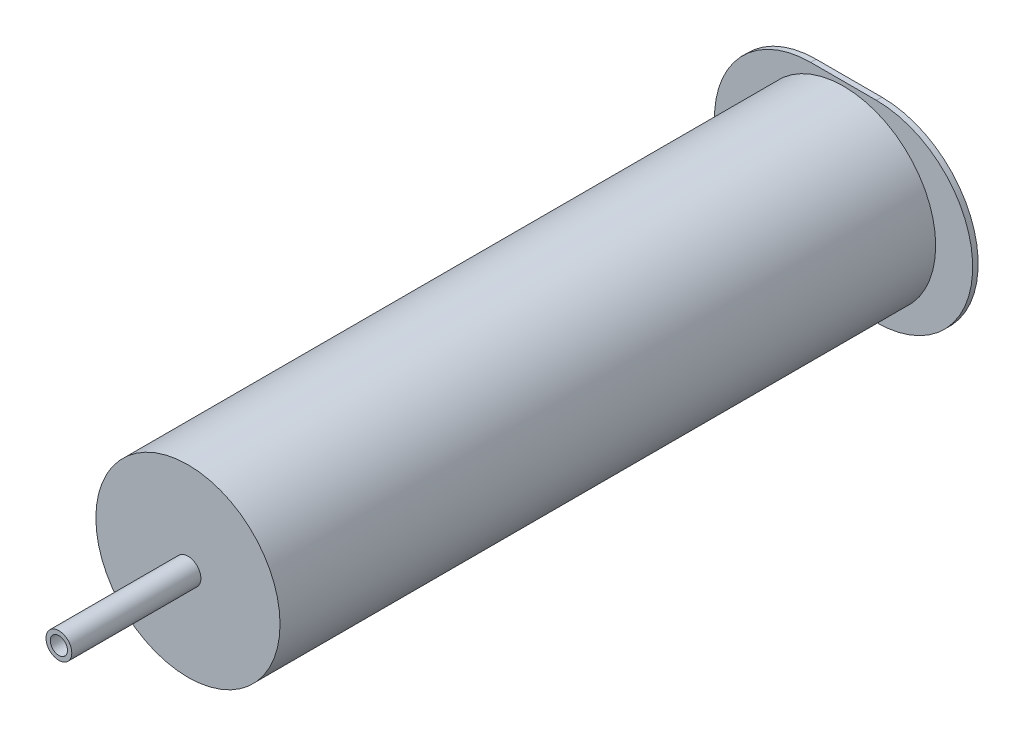
ISO-10303-21;
HEADER;
FILE_DESCRIPTION(('STEP AP214'),'2;1');
FILE_NAME('part.step','',(''),(''),'','','');
FILE_SCHEMA(('AUTOMOTIVE_DESIGN { 1 0 10303 214 1 1 1 1 }'));
ENDSEC;
DATA;
#1=APPLICATION_CONTEXT('core data for automotive mechanical design processes');
#2=APPLICATION_PROTOCOL_DEFINITION('international standard','automotive_design',2000,#1);
#3=PRODUCT_CONTEXT('',#1,'mechanical');
#4=PRODUCT('Part','Part','',(#3));
#5=PRODUCT_RELATED_PRODUCT_CATEGORY('part','',(#4));
#6=PRODUCT_DEFINITION_FORMATION('','',#4);
#7=PRODUCT_DEFINITION_CONTEXT('part definition',#1,'design');
#8=PRODUCT_DEFINITION('design','',#6,#7);
#9=PRODUCT_DEFINITION_SHAPE('','',#8);
#10=(LENGTH_UNIT() NAMED_UNIT(*) SI_UNIT(.MILLI.,.METRE.));
#11=(NAMED_UNIT(*) PLANE_ANGLE_UNIT() SI_UNIT($,.RADIAN.));
#12=(NAMED_UNIT(*) SI_UNIT($,.STERADIAN.) SOLID_ANGLE_UNIT());
#13=UNCERTAINTY_MEASURE_WITH_UNIT(LENGTH_MEASURE(1.E-05),#10,'distance_accuracy_value','');
#14=(GEOMETRIC_REPRESENTATION_CONTEXT(3) GLOBAL_UNCERTAINTY_ASSIGNED_CONTEXT((#13)) GLOBAL_UNIT_ASSIGNED_CONTEXT((#10,
#11,#12)) REPRESENTATION_CONTEXT('',''));
#15=CARTESIAN_POINT('',(0.,0.,0.));
#16=DIRECTION('',(0.,0.,1.));
#17=DIRECTION('',(1.,0.,0.));
#18=AXIS2_PLACEMENT_3D('',#15,#16,#17);
#19=CARTESIAN_POINT('',(-7.64,0.,1.27));
#20=DIRECTION('',(0.,0.,-1.));
#21=DIRECTION('',(-1.,0.,0.));
#22=AXIS2_PLACEMENT_3D('',#19,#20,#21);
#23=CYLINDRICAL_SURFACE('',#22,22.37);
#24=CARTESIAN_POINT('',(-7.64,0.,0.));
#25=DIRECTION('',(0.,0.,1.));
#26=DIRECTION('',(1.,0.,0.));
#27=AXIS2_PLACEMENT_3D('',#24,#25,#26);
#28=CIRCLE('',#27,22.37);
#29=CARTESIAN_POINT('',(-7.64000000000001,22.37,0.));
#30=VERTEX_POINT('',#29);
#31=CARTESIAN_POINT('',(-7.64000000000001,-22.37,0.));
#32=VERTEX_POINT('',#31);
#33=EDGE_CURVE('E111',#30,#32,#28,.T.);
#34=ORIENTED_EDGE('',*,*,#33,.T.);
#35=DIRECTION('',(0.,0.,-1.));
#36=VECTOR('',#35,1.);
#37=CARTESIAN_POINT('',(-7.64000000000001,-22.37,1.27));
#38=LINE('',#37,#36);
#39=CARTESIAN_POINT('',(-7.64000000000001,-22.37,1.27));
#40=VERTEX_POINT('',#39);
#41=EDGE_CURVE('E100',#40,#32,#38,.T.);
#42=ORIENTED_EDGE('',*,*,#41,.F.);
#43=CARTESIAN_POINT('',(-7.64,0.,1.27));
#44=DIRECTION('',(0.,0.,1.));
#45=DIRECTION('',(1.,0.,0.));
#46=AXIS2_PLACEMENT_3D('',#43,#44,#45);
#47=CIRCLE('',#46,22.37);
#48=CARTESIAN_POINT('',(-7.64000000000001,22.37,1.27));
#49=VERTEX_POINT('',#48);
#50=EDGE_CURVE('E92',#49,#40,#47,.T.);
#51=ORIENTED_EDGE('',*,*,#50,.F.);
#52=DIRECTION('',(0.,0.,-1.));
#53=VECTOR('',#52,1.);
#54=CARTESIAN_POINT('',(-7.64000000000001,22.37,1.27));
#55=LINE('',#54,#53);
#56=EDGE_CURVE('E107',#49,#30,#55,.T.);
#57=ORIENTED_EDGE('',*,*,#56,.T.);
#58=EDGE_LOOP('',(#34,#42,#51,#57));
#59=FACE_BOUND('',#58,.T.);
#60=ADVANCED_FACE('F39',(#59),#23,.T.);
#61=CARTESIAN_POINT('',(-7.64000000000001,-22.37,1.27));
#62=DIRECTION('',(0.,1.,0.));
#63=DIRECTION('',(0.,0.,1.));
#64=AXIS2_PLACEMENT_3D('',#61,#62,#63);
#65=PLANE('',#64);
#66=DIRECTION('',(1.,0.,0.));
#67=VECTOR('',#66,1.);
#68=CARTESIAN_POINT('',(-7.64000000000001,-22.37,0.));
#69=LINE('',#68,#67);
#70=CARTESIAN_POINT('',(7.64,-22.37,0.));
#71=VERTEX_POINT('',#70);
#72=EDGE_CURVE('E98',#32,#71,#69,.T.);
#73=ORIENTED_EDGE('',*,*,#72,.T.);
#74=DIRECTION('',(0.,0.,-1.));
#75=VECTOR('',#74,1.);
#76=CARTESIAN_POINT('',(7.64,-22.37,1.27));
#77=LINE('',#76,#75);
#78=CARTESIAN_POINT('',(7.64,-22.37,1.27));
#79=VERTEX_POINT('',#78);
#80=EDGE_CURVE('E96',#79,#71,#77,.T.);
#81=ORIENTED_EDGE('',*,*,#80,.F.);
#82=DIRECTION('',(1.,0.,0.));
#83=VECTOR('',#82,1.);
#84=CARTESIAN_POINT('',(-7.64000000000001,-22.37,1.27));
#85=LINE('',#84,#83);
#86=EDGE_CURVE('E87',#40,#79,#85,.T.);
#87=ORIENTED_EDGE('',*,*,#86,.F.);
#88=ORIENTED_EDGE('',*,*,#41,.T.);
#89=EDGE_LOOP('',(#73,#81,#87,#88));
#90=FACE_BOUND('',#89,.T.);
#91=ADVANCED_FACE('F97',(#90),#65,.F.);
#92=CARTESIAN_POINT('',(7.64,0.,1.27));
#93=DIRECTION('',(0.,0.,-1.));
#94=DIRECTION('',(-1.,0.,0.));
#95=AXIS2_PLACEMENT_3D('',#92,#93,#94);
#96=CYLINDRICAL_SURFACE('',#95,22.37);
#97=CARTESIAN_POINT('',(7.64,0.,0.));
#98=DIRECTION('',(0.,0.,1.));
#99=DIRECTION('',(1.,0.,0.));
#100=AXIS2_PLACEMENT_3D('',#97,#98,#99);
#101=CIRCLE('',#100,22.37);
#102=CARTESIAN_POINT('',(7.64000000000001,22.37,0.));
#103=VERTEX_POINT('',#102);
#104=EDGE_CURVE('E73',#71,#103,#101,.T.);
#105=ORIENTED_EDGE('',*,*,#104,.T.);
#106=DIRECTION('',(0.,0.,-1.));
#107=VECTOR('',#106,1.);
#108=CARTESIAN_POINT('',(7.64000000000001,22.37,1.27));
#109=LINE('',#108,#107);
#110=CARTESIAN_POINT('',(7.64000000000001,22.37,1.27));
#111=VERTEX_POINT('',#110);
#112=EDGE_CURVE('E101',#111,#103,#109,.T.);
#113=ORIENTED_EDGE('',*,*,#112,.F.);
#114=CARTESIAN_POINT('',(7.64,0.,1.27));
#115=DIRECTION('',(0.,0.,1.));
#116=DIRECTION('',(1.,0.,0.));
#117=AXIS2_PLACEMENT_3D('',#114,#115,#116);
#118=CIRCLE('',#117,22.37);
#119=EDGE_CURVE('E90',#79,#111,#118,.T.);
#120=ORIENTED_EDGE('',*,*,#119,.F.);
#121=ORIENTED_EDGE('',*,*,#80,.T.);
#122=EDGE_LOOP('',(#105,#113,#120,#121));
#123=FACE_BOUND('',#122,.T.);
#124=ADVANCED_FACE('F103',(#123),#96,.T.);
#125=CARTESIAN_POINT('',(-7.64000000000001,22.37,1.27));
#126=DIRECTION('',(0.,-1.,0.));
#127=DIRECTION('',(0.,0.,-1.));
#128=AXIS2_PLACEMENT_3D('',#125,#126,#127);
#129=PLANE('',#128);
#130=DIRECTION('',(-1.,0.,0.));
#131=VECTOR('',#130,1.);
#132=CARTESIAN_POINT('',(-7.64000000000001,22.37,0.));
#133=LINE('',#132,#131);
#134=EDGE_CURVE('E79',#103,#30,#133,.T.);
#135=ORIENTED_EDGE('',*,*,#134,.T.);
#136=ORIENTED_EDGE('',*,*,#56,.F.);
#137=DIRECTION('',(-1.,0.,0.));
#138=VECTOR('',#137,1.);
#139=CARTESIAN_POINT('',(-7.64000000000001,22.37,1.27));
#140=LINE('',#139,#138);
#141=EDGE_CURVE('E56',#111,#49,#140,.T.);
#142=ORIENTED_EDGE('',*,*,#141,.F.);
#143=ORIENTED_EDGE('',*,*,#112,.T.);
#144=EDGE_LOOP('',(#135,#136,#142,#143));
#145=FACE_BOUND('',#144,.T.);
#146=ADVANCED_FACE('F195',(#145),#129,.F.);
#147=CARTESIAN_POINT('',(-7.64,0.,1.27));
#148=DIRECTION('',(0.,0.,1.));
#149=DIRECTION('',(1.,0.,0.));
#150=AXIS2_PLACEMENT_3D('',#147,#148,#149);
#151=PLANE('',#150);
#152=CARTESIAN_POINT('',(0.,0.,1.27));
#153=DIRECTION('',(0.,0.,1.));
#154=DIRECTION('',(1.,0.,0.));
#155=AXIS2_PLACEMENT_3D('',#152,#153,#154);
#156=CIRCLE('',#155,21.405);
#157=CARTESIAN_POINT('',(21.405,0.,1.27));
#158=VERTEX_POINT('',#157);
#159=EDGE_CURVE('E48',#158,#158,#156,.T.);
#160=ORIENTED_EDGE('',*,*,#159,.F.);
#161=EDGE_LOOP('',(#160));
#162=FACE_BOUND('',#161,.T.);
#163=ORIENTED_EDGE('',*,*,#50,.T.);
#164=ORIENTED_EDGE('',*,*,#86,.T.);
#165=ORIENTED_EDGE('',*,*,#119,.T.);
#166=ORIENTED_EDGE('',*,*,#141,.T.);
#167=EDGE_LOOP('',(#163,#164,#165,#166));
#168=FACE_BOUND('',#167,.T.);
#169=ADVANCED_FACE('F88',(#162,#168),#151,.T.);
#170=CARTESIAN_POINT('',(-7.64,0.,0.));
#171=DIRECTION('',(0.,0.,1.));
#172=DIRECTION('',(1.,0.,0.));
#173=AXIS2_PLACEMENT_3D('',#170,#171,#172);
#174=PLANE('',#173);
#175=CARTESIAN_POINT('',(0.,0.,0.));
#176=DIRECTION('',(0.,0.,-1.));
#177=DIRECTION('',(-1.,0.,0.));
#178=AXIS2_PLACEMENT_3D('',#175,#176,#177);
#179=CIRCLE('',#178,20.5);
#180=CARTESIAN_POINT('',(-20.5,0.,0.));
#181=VERTEX_POINT('',#180);
#182=EDGE_CURVE('E140',#181,#181,#179,.T.);
#183=ORIENTED_EDGE('',*,*,#182,.F.);
#184=EDGE_LOOP('',(#183));
#185=FACE_BOUND('',#184,.T.);
#186=ORIENTED_EDGE('',*,*,#33,.F.);
#187=ORIENTED_EDGE('',*,*,#134,.F.);
#188=ORIENTED_EDGE('',*,*,#104,.F.);
#189=ORIENTED_EDGE('',*,*,#72,.F.);
#190=EDGE_LOOP('',(#186,#187,#188,#189));
#191=FACE_BOUND('',#190,.T.);
#192=ADVANCED_FACE('F183',(#185,#191),#174,.F.);
#193=CARTESIAN_POINT('',(0.,0.,153.67));
#194=DIRECTION('',(0.,0.,-1.));
#195=DIRECTION('',(-1.,0.,0.));
#196=AXIS2_PLACEMENT_3D('',#193,#194,#195);
#197=CYLINDRICAL_SURFACE('',#196,21.405);
#198=CARTESIAN_POINT('',(0.,0.,153.67));
#199=DIRECTION('',(0.,0.,1.));
#200=DIRECTION('',(1.,0.,0.));
#201=AXIS2_PLACEMENT_3D('',#198,#199,#200);
#202=CIRCLE('',#201,21.405);
#203=CARTESIAN_POINT('',(21.405,0.,153.67));
#204=VERTEX_POINT('',#203);
#205=EDGE_CURVE('E115',#204,#204,#202,.T.);
#206=ORIENTED_EDGE('',*,*,#205,.F.);
#207=EDGE_LOOP('',(#206));
#208=FACE_BOUND('',#207,.T.);
#209=ORIENTED_EDGE('',*,*,#159,.T.);
#210=EDGE_LOOP('',(#209));
#211=FACE_BOUND('',#210,.T.);
#212=ADVANCED_FACE('F185',(#208,#211),#197,.T.);
#213=CARTESIAN_POINT('',(0.,0.,153.67));
#214=DIRECTION('',(0.,0.,1.));
#215=DIRECTION('',(1.,0.,0.));
#216=AXIS2_PLACEMENT_3D('',#213,#214,#215);
#217=PLANE('',#216);
#218=CARTESIAN_POINT('',(0.,0.,153.67));
#219=DIRECTION('',(0.,0.,1.));
#220=DIRECTION('',(1.,0.,0.));
#221=AXIS2_PLACEMENT_3D('',#218,#219,#220);
#222=CIRCLE('',#221,3.);
#223=CARTESIAN_POINT('',(3.,0.,153.67));
#224=VERTEX_POINT('',#223);
#225=EDGE_CURVE('E147',#224,#224,#222,.T.);
#226=ORIENTED_EDGE('',*,*,#225,.F.);
#227=EDGE_LOOP('',(#226));
#228=FACE_BOUND('',#227,.T.);
#229=ORIENTED_EDGE('',*,*,#205,.T.);
#230=EDGE_LOOP('',(#229));
#231=FACE_BOUND('',#230,.T.);
#232=ADVANCED_FACE('F192',(#228,#231),#217,.T.);
#233=CARTESIAN_POINT('',(0.,0.,149.86));
#234=DIRECTION('',(0.,0.,-1.));
#235=DIRECTION('',(-1.,0.,0.));
#236=AXIS2_PLACEMENT_3D('',#233,#234,#235);
#237=CYLINDRICAL_SURFACE('',#236,20.5);
#238=CARTESIAN_POINT('',(0.,0.,149.86));
#239=DIRECTION('',(0.,0.,-1.));
#240=DIRECTION('',(-1.,0.,0.));
#241=AXIS2_PLACEMENT_3D('',#238,#239,#240);
#242=CIRCLE('',#241,20.5);
#243=CARTESIAN_POINT('',(-20.5,0.,149.86));
#244=VERTEX_POINT('',#243);
#245=EDGE_CURVE('E137',#244,#244,#242,.T.);
#246=ORIENTED_EDGE('',*,*,#245,.F.);
#247=EDGE_LOOP('',(#246));
#248=FACE_BOUND('',#247,.T.);
#249=ORIENTED_EDGE('',*,*,#182,.T.);
#250=EDGE_LOOP('',(#249));
#251=FACE_BOUND('',#250,.T.);
#252=ADVANCED_FACE('F172',(#248,#251),#237,.F.);
#253=CARTESIAN_POINT('',(0.,0.,149.86));
#254=DIRECTION('',(0.,0.,-1.));
#255=DIRECTION('',(-1.,0.,0.));
#256=AXIS2_PLACEMENT_3D('',#253,#254,#255);
#257=PLANE('',#256);
#258=ORIENTED_EDGE('',*,*,#245,.T.);
#259=EDGE_LOOP('',(#258));
#260=FACE_BOUND('',#259,.T.);
#261=ADVANCED_FACE('F163',(#260),#257,.T.);
#262=CARTESIAN_POINT('',(0.,0.,183.67));
#263=DIRECTION('',(0.,0.,1.));
#264=DIRECTION('',(1.,0.,0.));
#265=AXIS2_PLACEMENT_3D('',#262,#263,#264);
#266=PLANE('',#265);
#267=CARTESIAN_POINT('',(0.,0.,183.67));
#268=DIRECTION('',(0.,0.,1.));
#269=DIRECTION('',(1.,0.,0.));
#270=AXIS2_PLACEMENT_3D('',#267,#268,#269);
#271=CIRCLE('',#270,3.);
#272=CARTESIAN_POINT('',(3.,0.,183.67));
#273=VERTEX_POINT('',#272);
#274=EDGE_CURVE('E144',#273,#273,#271,.T.);
#275=ORIENTED_EDGE('',*,*,#274,.T.);
#276=EDGE_LOOP('',(#275));
#277=FACE_BOUND('',#276,.T.);
#278=CARTESIAN_POINT('',(0.,0.,183.67));
#279=DIRECTION('',(0.,0.,1.));
#280=DIRECTION('',(1.,0.,0.));
#281=AXIS2_PLACEMENT_3D('',#278,#279,#280);
#282=CIRCLE('',#281,2.);
#283=CARTESIAN_POINT('',(2.,0.,183.67));
#284=VERTEX_POINT('',#283);
#285=EDGE_CURVE('E151',#284,#284,#282,.T.);
#286=ORIENTED_EDGE('',*,*,#285,.F.);
#287=EDGE_LOOP('',(#286));
#288=FACE_BOUND('',#287,.T.);
#289=ADVANCED_FACE('F160',(#277,#288),#266,.T.);
#290=CARTESIAN_POINT('',(0.,0.,183.67));
#291=DIRECTION('',(0.,0.,-1.));
#292=DIRECTION('',(-1.,0.,0.));
#293=AXIS2_PLACEMENT_3D('',#290,#291,#292);
#294=CYLINDRICAL_SURFACE('',#293,3.);
#295=ORIENTED_EDGE('',*,*,#274,.F.);
#296=EDGE_LOOP('',(#295));
#297=FACE_BOUND('',#296,.T.);
#298=ORIENTED_EDGE('',*,*,#225,.T.);
#299=EDGE_LOOP('',(#298));
#300=FACE_BOUND('',#299,.T.);
#301=ADVANCED_FACE('F162',(#297,#300),#294,.T.);
#302=CARTESIAN_POINT('',(0.,0.,183.67));
#303=DIRECTION('',(0.,0.,-1.));
#304=DIRECTION('',(-1.,0.,0.));
#305=AXIS2_PLACEMENT_3D('',#302,#303,#304);
#306=CYLINDRICAL_SURFACE('',#305,2.);
#307=ORIENTED_EDGE('',*,*,#285,.T.);
#308=EDGE_LOOP('',(#307));
#309=FACE_BOUND('',#308,.T.);
#310=CARTESIAN_POINT('',(0.,0.,153.67));
#311=DIRECTION('',(0.,0.,1.));
#312=DIRECTION('',(1.,0.,0.));
#313=AXIS2_PLACEMENT_3D('',#310,#311,#312);
#314=CIRCLE('',#313,2.);
#315=CARTESIAN_POINT('',(2.,0.,153.67));
#316=VERTEX_POINT('',#315);
#317=EDGE_CURVE('E11',#316,#316,#314,.F.);
#318=ORIENTED_EDGE('',*,*,#317,.T.);
#319=EDGE_LOOP('',(#318));
#320=FACE_BOUND('',#319,.T.);
#321=ADVANCED_FACE('F157',(#309,#320),#306,.F.);
#322=ORIENTED_EDGE('',*,*,#317,.F.);
#323=EDGE_LOOP('',(#322));
#324=FACE_BOUND('',#323,.T.);
#325=ADVANCED_FACE('F251',(#324),#217,.T.);
#326=CLOSED_SHELL('',(#60,#91,#124,#146,#169,#192,#212,#232,#252,#261,#289,#301,#321,#325));
#327=MANIFOLD_SOLID_BREP('B2',#326);
#328=ADVANCED_BREP_SHAPE_REPRESENTATION('',(#18,#327),#14);
#329=SHAPE_DEFINITION_REPRESENTATION(#9,#328);
ENDSEC;
END-ISO-10303-21;
